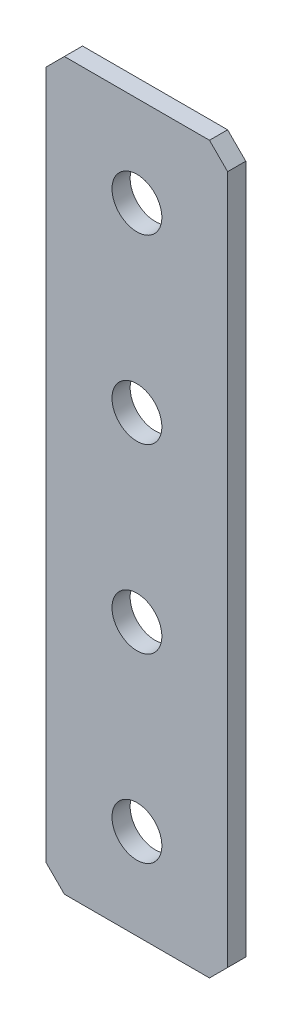
ISO-10303-21;
HEADER;
FILE_DESCRIPTION(('STEP AP214'),'2;1');
FILE_NAME('part.step','',(''),(''),'','','');
FILE_SCHEMA(('AUTOMOTIVE_DESIGN { 1 0 10303 214 1 1 1 1 }'));
ENDSEC;
DATA;
#1=APPLICATION_CONTEXT('core data for automotive mechanical design processes');
#2=APPLICATION_PROTOCOL_DEFINITION('international standard','automotive_design',2000,#1);
#3=PRODUCT_CONTEXT('',#1,'mechanical');
#4=PRODUCT('Part','Part','',(#3));
#5=PRODUCT_RELATED_PRODUCT_CATEGORY('part','',(#4));
#6=PRODUCT_DEFINITION_FORMATION('','',#4);
#7=PRODUCT_DEFINITION_CONTEXT('part definition',#1,'design');
#8=PRODUCT_DEFINITION('design','',#6,#7);
#9=PRODUCT_DEFINITION_SHAPE('','',#8);
#10=(LENGTH_UNIT() NAMED_UNIT(*) SI_UNIT(.MILLI.,.METRE.));
#11=(NAMED_UNIT(*) PLANE_ANGLE_UNIT() SI_UNIT($,.RADIAN.));
#12=(NAMED_UNIT(*) SI_UNIT($,.STERADIAN.) SOLID_ANGLE_UNIT());
#13=UNCERTAINTY_MEASURE_WITH_UNIT(LENGTH_MEASURE(1.E-05),#10,'distance_accuracy_value','');
#14=(GEOMETRIC_REPRESENTATION_CONTEXT(3) GLOBAL_UNCERTAINTY_ASSIGNED_CONTEXT((#13)) GLOBAL_UNIT_ASSIGNED_CONTEXT((#10,
#11,#12)) REPRESENTATION_CONTEXT('',''));
#15=CARTESIAN_POINT('',(0.,0.,0.));
#16=DIRECTION('',(0.,0.,1.));
#17=DIRECTION('',(1.,0.,0.));
#18=AXIS2_PLACEMENT_3D('',#15,#16,#17);
#19=CARTESIAN_POINT('',(9.99999999999999,-40.,2.));
#20=DIRECTION('',(-1.,0.,0.));
#21=DIRECTION('',(0.,0.,1.));
#22=AXIS2_PLACEMENT_3D('',#19,#20,#21);
#23=PLANE('',#22);
#24=DIRECTION('',(0.,1.,0.));
#25=VECTOR('',#24,1.);
#26=CARTESIAN_POINT('',(9.99999999999999,-40.,2.));
#27=LINE('',#26,#25);
#28=CARTESIAN_POINT('',(9.99999999999999,-38.,2.));
#29=VERTEX_POINT('',#28);
#30=CARTESIAN_POINT('',(9.99999999999999,38.,2.));
#31=VERTEX_POINT('',#30);
#32=EDGE_CURVE('E127',#29,#31,#27,.T.);
#33=ORIENTED_EDGE('',*,*,#32,.F.);
#34=DIRECTION('',(0.,0.,-1.));
#35=VECTOR('',#34,1.);
#36=CARTESIAN_POINT('',(9.99999999999999,-38.,2.));
#37=LINE('',#36,#35);
#38=CARTESIAN_POINT('',(9.99999999999999,-38.,0.));
#39=VERTEX_POINT('',#38);
#40=EDGE_CURVE('E153',#29,#39,#37,.T.);
#41=ORIENTED_EDGE('',*,*,#40,.T.);
#42=DIRECTION('',(0.,1.,0.));
#43=VECTOR('',#42,1.);
#44=CARTESIAN_POINT('',(9.99999999999999,-40.,0.));
#45=LINE('',#44,#43);
#46=CARTESIAN_POINT('',(9.99999999999999,38.,0.));
#47=VERTEX_POINT('',#46);
#48=EDGE_CURVE('E161',#39,#47,#45,.T.);
#49=ORIENTED_EDGE('',*,*,#48,.T.);
#50=DIRECTION('',(0.,0.,1.));
#51=VECTOR('',#50,1.);
#52=CARTESIAN_POINT('',(9.99999999999999,38.,2.));
#53=LINE('',#52,#51);
#54=EDGE_CURVE('E151',#47,#31,#53,.T.);
#55=ORIENTED_EDGE('',*,*,#54,.T.);
#56=EDGE_LOOP('',(#33,#41,#49,#55));
#57=FACE_BOUND('',#56,.T.);
#58=ADVANCED_FACE('F36',(#57),#23,.F.);
#59=CARTESIAN_POINT('',(-10.,40.,2.));
#60=DIRECTION('',(0.,-1.,0.));
#61=DIRECTION('',(0.,0.,-1.));
#62=AXIS2_PLACEMENT_3D('',#59,#60,#61);
#63=PLANE('',#62);
#64=DIRECTION('',(-1.,0.,0.));
#65=VECTOR('',#64,1.);
#66=CARTESIAN_POINT('',(-10.,40.,0.));
#67=LINE('',#66,#65);
#68=CARTESIAN_POINT('',(7.99999999999998,40.,0.));
#69=VERTEX_POINT('',#68);
#70=CARTESIAN_POINT('',(-8.00000000000001,40.,0.));
#71=VERTEX_POINT('',#70);
#72=EDGE_CURVE('E132',#69,#71,#67,.T.);
#73=ORIENTED_EDGE('',*,*,#72,.T.);
#74=DIRECTION('',(0.,0.,1.));
#75=VECTOR('',#74,1.);
#76=CARTESIAN_POINT('',(-8.00000000000001,40.,2.));
#77=LINE('',#76,#75);
#78=CARTESIAN_POINT('',(-8.00000000000001,40.,2.));
#79=VERTEX_POINT('',#78);
#80=EDGE_CURVE('E11',#71,#79,#77,.T.);
#81=ORIENTED_EDGE('',*,*,#80,.T.);
#82=DIRECTION('',(-1.,0.,0.));
#83=VECTOR('',#82,1.);
#84=CARTESIAN_POINT('',(-10.,40.,2.));
#85=LINE('',#84,#83);
#86=CARTESIAN_POINT('',(7.99999999999998,40.,2.));
#87=VERTEX_POINT('',#86);
#88=EDGE_CURVE('E130',#87,#79,#85,.T.);
#89=ORIENTED_EDGE('',*,*,#88,.F.);
#90=DIRECTION('',(0.,0.,-1.));
#91=VECTOR('',#90,1.);
#92=CARTESIAN_POINT('',(7.99999999999998,40.,2.));
#93=LINE('',#92,#91);
#94=EDGE_CURVE('E44',#87,#69,#93,.T.);
#95=ORIENTED_EDGE('',*,*,#94,.T.);
#96=EDGE_LOOP('',(#73,#81,#89,#95));
#97=FACE_BOUND('',#96,.T.);
#98=ADVANCED_FACE('F158',(#97),#63,.F.);
#99=CARTESIAN_POINT('',(-10.,-40.,2.));
#100=DIRECTION('',(1.,0.,0.));
#101=DIRECTION('',(0.,0.,-1.));
#102=AXIS2_PLACEMENT_3D('',#99,#100,#101);
#103=PLANE('',#102);
#104=DIRECTION('',(0.,-1.,0.));
#105=VECTOR('',#104,1.);
#106=CARTESIAN_POINT('',(-10.,-40.,0.));
#107=LINE('',#106,#105);
#108=CARTESIAN_POINT('',(-10.,38.,0.));
#109=VERTEX_POINT('',#108);
#110=CARTESIAN_POINT('',(-10.,-38.,0.));
#111=VERTEX_POINT('',#110);
#112=EDGE_CURVE('E128',#109,#111,#107,.T.);
#113=ORIENTED_EDGE('',*,*,#112,.T.);
#114=DIRECTION('',(0.,0.,1.));
#115=VECTOR('',#114,1.);
#116=CARTESIAN_POINT('',(-10.,-38.,2.));
#117=LINE('',#116,#115);
#118=CARTESIAN_POINT('',(-10.,-38.,2.));
#119=VERTEX_POINT('',#118);
#120=EDGE_CURVE('E106',#111,#119,#117,.T.);
#121=ORIENTED_EDGE('',*,*,#120,.T.);
#122=DIRECTION('',(0.,-1.,0.));
#123=VECTOR('',#122,1.);
#124=CARTESIAN_POINT('',(-10.,-40.,2.));
#125=LINE('',#124,#123);
#126=CARTESIAN_POINT('',(-10.,38.,2.));
#127=VERTEX_POINT('',#126);
#128=EDGE_CURVE('E166',#127,#119,#125,.T.);
#129=ORIENTED_EDGE('',*,*,#128,.F.);
#130=DIRECTION('',(0.,0.,-1.));
#131=VECTOR('',#130,1.);
#132=CARTESIAN_POINT('',(-10.,38.,2.));
#133=LINE('',#132,#131);
#134=EDGE_CURVE('E111',#127,#109,#133,.T.);
#135=ORIENTED_EDGE('',*,*,#134,.T.);
#136=EDGE_LOOP('',(#113,#121,#129,#135));
#137=FACE_BOUND('',#136,.T.);
#138=ADVANCED_FACE('F209',(#137),#103,.F.);
#139=CARTESIAN_POINT('',(-10.,-40.,2.));
#140=DIRECTION('',(0.,1.,0.));
#141=DIRECTION('',(0.,0.,1.));
#142=AXIS2_PLACEMENT_3D('',#139,#140,#141);
#143=PLANE('',#142);
#144=DIRECTION('',(1.,0.,0.));
#145=VECTOR('',#144,1.);
#146=CARTESIAN_POINT('',(-10.,-40.,2.));
#147=LINE('',#146,#145);
#148=CARTESIAN_POINT('',(-7.99999999999999,-40.,2.));
#149=VERTEX_POINT('',#148);
#150=CARTESIAN_POINT('',(7.99999999999997,-40.,2.));
#151=VERTEX_POINT('',#150);
#152=EDGE_CURVE('E121',#149,#151,#147,.T.);
#153=ORIENTED_EDGE('',*,*,#152,.F.);
#154=DIRECTION('',(0.,0.,-1.));
#155=VECTOR('',#154,1.);
#156=CARTESIAN_POINT('',(-7.99999999999999,-40.,2.));
#157=LINE('',#156,#155);
#158=CARTESIAN_POINT('',(-7.99999999999999,-40.,0.));
#159=VERTEX_POINT('',#158);
#160=EDGE_CURVE('E105',#149,#159,#157,.T.);
#161=ORIENTED_EDGE('',*,*,#160,.T.);
#162=DIRECTION('',(1.,0.,0.));
#163=VECTOR('',#162,1.);
#164=CARTESIAN_POINT('',(-10.,-40.,0.));
#165=LINE('',#164,#163);
#166=CARTESIAN_POINT('',(7.99999999999997,-40.,0.));
#167=VERTEX_POINT('',#166);
#168=EDGE_CURVE('E118',#159,#167,#165,.T.);
#169=ORIENTED_EDGE('',*,*,#168,.T.);
#170=DIRECTION('',(0.,0.,1.));
#171=VECTOR('',#170,1.);
#172=CARTESIAN_POINT('',(7.99999999999997,-40.,2.));
#173=LINE('',#172,#171);
#174=EDGE_CURVE('E123',#167,#151,#173,.T.);
#175=ORIENTED_EDGE('',*,*,#174,.T.);
#176=EDGE_LOOP('',(#153,#161,#169,#175));
#177=FACE_BOUND('',#176,.T.);
#178=ADVANCED_FACE('F117',(#177),#143,.F.);
#179=CARTESIAN_POINT('',(0.,0.,2.));
#180=DIRECTION('',(0.,0.,-1.));
#181=DIRECTION('',(-1.,0.,0.));
#182=AXIS2_PLACEMENT_3D('',#179,#180,#181);
#183=PLANE('',#182);
#184=CARTESIAN_POINT('',(0.,30.,2.));
#185=DIRECTION('',(0.,0.,1.));
#186=DIRECTION('',(1.,0.,0.));
#187=AXIS2_PLACEMENT_3D('',#184,#185,#186);
#188=CIRCLE('',#187,2.75);
#189=CARTESIAN_POINT('',(2.75,30.,2.));
#190=VERTEX_POINT('',#189);
#191=EDGE_CURVE('E190',#190,#190,#188,.T.);
#192=ORIENTED_EDGE('',*,*,#191,.F.);
#193=EDGE_LOOP('',(#192));
#194=FACE_BOUND('',#193,.T.);
#195=CARTESIAN_POINT('',(0.,10.,2.));
#196=DIRECTION('',(0.,0.,1.));
#197=DIRECTION('',(1.,0.,0.));
#198=AXIS2_PLACEMENT_3D('',#195,#196,#197);
#199=CIRCLE('',#198,2.75);
#200=CARTESIAN_POINT('',(2.75,10.,2.));
#201=VERTEX_POINT('',#200);
#202=EDGE_CURVE('E184',#201,#201,#199,.T.);
#203=ORIENTED_EDGE('',*,*,#202,.F.);
#204=EDGE_LOOP('',(#203));
#205=FACE_BOUND('',#204,.T.);
#206=CARTESIAN_POINT('',(0.,-10.,2.));
#207=DIRECTION('',(0.,0.,1.));
#208=DIRECTION('',(1.,0.,0.));
#209=AXIS2_PLACEMENT_3D('',#206,#207,#208);
#210=CIRCLE('',#209,2.75);
#211=CARTESIAN_POINT('',(2.75000000000001,-10.,2.));
#212=VERTEX_POINT('',#211);
#213=EDGE_CURVE('E178',#212,#212,#210,.T.);
#214=ORIENTED_EDGE('',*,*,#213,.F.);
#215=EDGE_LOOP('',(#214));
#216=FACE_BOUND('',#215,.T.);
#217=CARTESIAN_POINT('',(0.,-30.,2.));
#218=DIRECTION('',(0.,0.,1.));
#219=DIRECTION('',(1.,0.,0.));
#220=AXIS2_PLACEMENT_3D('',#217,#218,#219);
#221=CIRCLE('',#220,2.75);
#222=CARTESIAN_POINT('',(2.75000000000001,-30.,2.));
#223=VERTEX_POINT('',#222);
#224=EDGE_CURVE('E172',#223,#223,#221,.T.);
#225=ORIENTED_EDGE('',*,*,#224,.F.);
#226=EDGE_LOOP('',(#225));
#227=FACE_BOUND('',#226,.T.);
#228=ORIENTED_EDGE('',*,*,#128,.T.);
#229=DIRECTION('',(-0.707106781186546,0.707106781186549,0.));
#230=VECTOR('',#229,1.);
#231=CARTESIAN_POINT('',(-7.99999999999999,-40.,2.));
#232=LINE('',#231,#230);
#233=EDGE_CURVE('E149',#119,#149,#232,.F.);
#234=ORIENTED_EDGE('',*,*,#233,.T.);
#235=ORIENTED_EDGE('',*,*,#152,.T.);
#236=DIRECTION('',(-0.707106781186549,-0.707106781186546,0.));
#237=VECTOR('',#236,1.);
#238=CARTESIAN_POINT('',(9.99999999999999,-38.,2.));
#239=LINE('',#238,#237);
#240=EDGE_CURVE('E147',#151,#29,#239,.F.);
#241=ORIENTED_EDGE('',*,*,#240,.T.);
#242=ORIENTED_EDGE('',*,*,#32,.T.);
#243=DIRECTION('',(0.707106781186546,-0.707106781186549,0.));
#244=VECTOR('',#243,1.);
#245=CARTESIAN_POINT('',(7.99999999999998,40.,2.));
#246=LINE('',#245,#244);
#247=EDGE_CURVE('E56',#31,#87,#246,.F.);
#248=ORIENTED_EDGE('',*,*,#247,.T.);
#249=ORIENTED_EDGE('',*,*,#88,.T.);
#250=DIRECTION('',(0.707106781186548,0.707106781186548,0.));
#251=VECTOR('',#250,1.);
#252=CARTESIAN_POINT('',(-10.,38.,2.));
#253=LINE('',#252,#251);
#254=EDGE_CURVE('E145',#79,#127,#253,.F.);
#255=ORIENTED_EDGE('',*,*,#254,.T.);
#256=EDGE_LOOP('',(#228,#234,#235,#241,#242,#248,#249,#255));
#257=FACE_BOUND('',#256,.T.);
#258=ADVANCED_FACE('F196',(#194,#205,#216,#227,#257),#183,.F.);
#259=CARTESIAN_POINT('',(0.,0.,0.));
#260=DIRECTION('',(0.,0.,-1.));
#261=DIRECTION('',(-1.,0.,0.));
#262=AXIS2_PLACEMENT_3D('',#259,#260,#261);
#263=PLANE('',#262);
#264=CARTESIAN_POINT('',(0.,30.,0.));
#265=DIRECTION('',(0.,0.,1.));
#266=DIRECTION('',(1.,0.,0.));
#267=AXIS2_PLACEMENT_3D('',#264,#265,#266);
#268=CIRCLE('',#267,2.75);
#269=CARTESIAN_POINT('',(2.75,30.,0.));
#270=VERTEX_POINT('',#269);
#271=EDGE_CURVE('E187',#270,#270,#268,.T.);
#272=ORIENTED_EDGE('',*,*,#271,.T.);
#273=EDGE_LOOP('',(#272));
#274=FACE_BOUND('',#273,.T.);
#275=CARTESIAN_POINT('',(0.,10.,0.));
#276=DIRECTION('',(0.,0.,1.));
#277=DIRECTION('',(1.,0.,0.));
#278=AXIS2_PLACEMENT_3D('',#275,#276,#277);
#279=CIRCLE('',#278,2.75);
#280=CARTESIAN_POINT('',(2.75,10.,0.));
#281=VERTEX_POINT('',#280);
#282=EDGE_CURVE('E181',#281,#281,#279,.T.);
#283=ORIENTED_EDGE('',*,*,#282,.T.);
#284=EDGE_LOOP('',(#283));
#285=FACE_BOUND('',#284,.T.);
#286=CARTESIAN_POINT('',(0.,-10.,0.));
#287=DIRECTION('',(0.,0.,1.));
#288=DIRECTION('',(1.,0.,0.));
#289=AXIS2_PLACEMENT_3D('',#286,#287,#288);
#290=CIRCLE('',#289,2.75);
#291=CARTESIAN_POINT('',(2.75000000000001,-10.,0.));
#292=VERTEX_POINT('',#291);
#293=EDGE_CURVE('E175',#292,#292,#290,.T.);
#294=ORIENTED_EDGE('',*,*,#293,.T.);
#295=EDGE_LOOP('',(#294));
#296=FACE_BOUND('',#295,.T.);
#297=CARTESIAN_POINT('',(0.,-30.,0.));
#298=DIRECTION('',(0.,0.,1.));
#299=DIRECTION('',(1.,0.,0.));
#300=AXIS2_PLACEMENT_3D('',#297,#298,#299);
#301=CIRCLE('',#300,2.75);
#302=CARTESIAN_POINT('',(2.75000000000001,-30.,0.));
#303=VERTEX_POINT('',#302);
#304=EDGE_CURVE('E162',#303,#303,#301,.T.);
#305=ORIENTED_EDGE('',*,*,#304,.T.);
#306=EDGE_LOOP('',(#305));
#307=FACE_BOUND('',#306,.T.);
#308=ORIENTED_EDGE('',*,*,#168,.F.);
#309=DIRECTION('',(0.707106781186546,-0.707106781186549,0.));
#310=VECTOR('',#309,1.);
#311=CARTESIAN_POINT('',(-24.,-23.9999999999999,0.));
#312=LINE('',#311,#310);
#313=EDGE_CURVE('E101',#159,#111,#312,.F.);
#314=ORIENTED_EDGE('',*,*,#313,.T.);
#315=ORIENTED_EDGE('',*,*,#112,.F.);
#316=DIRECTION('',(-0.707106781186548,-0.707106781186548,0.));
#317=VECTOR('',#316,1.);
#318=CARTESIAN_POINT('',(-24.,24.,0.));
#319=LINE('',#318,#317);
#320=EDGE_CURVE('E138',#109,#71,#319,.F.);
#321=ORIENTED_EDGE('',*,*,#320,.T.);
#322=ORIENTED_EDGE('',*,*,#72,.F.);
#323=DIRECTION('',(-0.707106781186546,0.707106781186549,0.));
#324=VECTOR('',#323,1.);
#325=CARTESIAN_POINT('',(24.,23.9999999999999,0.));
#326=LINE('',#325,#324);
#327=EDGE_CURVE('E122',#69,#47,#326,.F.);
#328=ORIENTED_EDGE('',*,*,#327,.T.);
#329=ORIENTED_EDGE('',*,*,#48,.F.);
#330=DIRECTION('',(0.707106781186549,0.707106781186546,0.));
#331=VECTOR('',#330,1.);
#332=CARTESIAN_POINT('',(24.,-24.0000000000001,0.));
#333=LINE('',#332,#331);
#334=EDGE_CURVE('E112',#39,#167,#333,.F.);
#335=ORIENTED_EDGE('',*,*,#334,.T.);
#336=EDGE_LOOP('',(#308,#314,#315,#321,#322,#328,#329,#335));
#337=FACE_BOUND('',#336,.T.);
#338=ADVANCED_FACE('F125',(#274,#285,#296,#307,#337),#263,.T.);
#339=CARTESIAN_POINT('',(-7.99999999999999,-40.,2.));
#340=DIRECTION('',(0.707106781186549,0.707106781186546,0.));
#341=DIRECTION('',(0.,0.,-1.));
#342=AXIS2_PLACEMENT_3D('',#339,#340,#341);
#343=PLANE('',#342);
#344=ORIENTED_EDGE('',*,*,#233,.F.);
#345=ORIENTED_EDGE('',*,*,#120,.F.);
#346=ORIENTED_EDGE('',*,*,#313,.F.);
#347=ORIENTED_EDGE('',*,*,#160,.F.);
#348=EDGE_LOOP('',(#344,#345,#346,#347));
#349=FACE_BOUND('',#348,.T.);
#350=ADVANCED_FACE('F104',(#349),#343,.F.);
#351=CARTESIAN_POINT('',(9.99999999999999,-38.,2.));
#352=DIRECTION('',(-0.707106781186546,0.707106781186549,0.));
#353=DIRECTION('',(0.,0.,-1.));
#354=AXIS2_PLACEMENT_3D('',#351,#352,#353);
#355=PLANE('',#354);
#356=ORIENTED_EDGE('',*,*,#240,.F.);
#357=ORIENTED_EDGE('',*,*,#174,.F.);
#358=ORIENTED_EDGE('',*,*,#334,.F.);
#359=ORIENTED_EDGE('',*,*,#40,.F.);
#360=EDGE_LOOP('',(#356,#357,#358,#359));
#361=FACE_BOUND('',#360,.T.);
#362=ADVANCED_FACE('F213',(#361),#355,.F.);
#363=CARTESIAN_POINT('',(-10.,38.,2.));
#364=DIRECTION('',(0.707106781186547,-0.707106781186547,0.));
#365=DIRECTION('',(0.,0.,-1.));
#366=AXIS2_PLACEMENT_3D('',#363,#364,#365);
#367=PLANE('',#366);
#368=ORIENTED_EDGE('',*,*,#254,.F.);
#369=ORIENTED_EDGE('',*,*,#80,.F.);
#370=ORIENTED_EDGE('',*,*,#320,.F.);
#371=ORIENTED_EDGE('',*,*,#134,.F.);
#372=EDGE_LOOP('',(#368,#369,#370,#371));
#373=FACE_BOUND('',#372,.T.);
#374=ADVANCED_FACE('F211',(#373),#367,.F.);
#375=CARTESIAN_POINT('',(7.99999999999998,40.,2.));
#376=DIRECTION('',(-0.707106781186549,-0.707106781186546,0.));
#377=DIRECTION('',(0.,0.,-1.));
#378=AXIS2_PLACEMENT_3D('',#375,#376,#377);
#379=PLANE('',#378);
#380=ORIENTED_EDGE('',*,*,#247,.F.);
#381=ORIENTED_EDGE('',*,*,#54,.F.);
#382=ORIENTED_EDGE('',*,*,#327,.F.);
#383=ORIENTED_EDGE('',*,*,#94,.F.);
#384=EDGE_LOOP('',(#380,#381,#382,#383));
#385=FACE_BOUND('',#384,.T.);
#386=ADVANCED_FACE('F38',(#385),#379,.F.);
#387=CARTESIAN_POINT('',(0.,-30.,2.));
#388=DIRECTION('',(0.,0.,1.));
#389=DIRECTION('',(1.,0.,0.));
#390=AXIS2_PLACEMENT_3D('',#387,#388,#389);
#391=CYLINDRICAL_SURFACE('',#390,2.75);
#392=ORIENTED_EDGE('',*,*,#304,.F.);
#393=EDGE_LOOP('',(#392));
#394=FACE_BOUND('',#393,.T.);
#395=ORIENTED_EDGE('',*,*,#224,.T.);
#396=EDGE_LOOP('',(#395));
#397=FACE_BOUND('',#396,.T.);
#398=ADVANCED_FACE('F218',(#394,#397),#391,.F.);
#399=CARTESIAN_POINT('',(0.,-10.,2.));
#400=DIRECTION('',(0.,0.,1.));
#401=DIRECTION('',(1.,0.,0.));
#402=AXIS2_PLACEMENT_3D('',#399,#400,#401);
#403=CYLINDRICAL_SURFACE('',#402,2.75);
#404=ORIENTED_EDGE('',*,*,#293,.F.);
#405=EDGE_LOOP('',(#404));
#406=FACE_BOUND('',#405,.T.);
#407=ORIENTED_EDGE('',*,*,#213,.T.);
#408=EDGE_LOOP('',(#407));
#409=FACE_BOUND('',#408,.T.);
#410=ADVANCED_FACE('F273',(#406,#409),#403,.F.);
#411=CARTESIAN_POINT('',(0.,10.,2.));
#412=DIRECTION('',(0.,0.,1.));
#413=DIRECTION('',(1.,0.,0.));
#414=AXIS2_PLACEMENT_3D('',#411,#412,#413);
#415=CYLINDRICAL_SURFACE('',#414,2.75);
#416=ORIENTED_EDGE('',*,*,#282,.F.);
#417=EDGE_LOOP('',(#416));
#418=FACE_BOUND('',#417,.T.);
#419=ORIENTED_EDGE('',*,*,#202,.T.);
#420=EDGE_LOOP('',(#419));
#421=FACE_BOUND('',#420,.T.);
#422=ADVANCED_FACE('F282',(#418,#421),#415,.F.);
#423=CARTESIAN_POINT('',(0.,30.,2.));
#424=DIRECTION('',(0.,0.,1.));
#425=DIRECTION('',(1.,0.,0.));
#426=AXIS2_PLACEMENT_3D('',#423,#424,#425);
#427=CYLINDRICAL_SURFACE('',#426,2.75);
#428=ORIENTED_EDGE('',*,*,#271,.F.);
#429=EDGE_LOOP('',(#428));
#430=FACE_BOUND('',#429,.T.);
#431=ORIENTED_EDGE('',*,*,#191,.T.);
#432=EDGE_LOOP('',(#431));
#433=FACE_BOUND('',#432,.T.);
#434=ADVANCED_FACE('F194',(#430,#433),#427,.F.);
#435=CLOSED_SHELL('',(#58,#98,#138,#178,#258,#338,#350,#362,#374,#386,#398,#410,#422,#434));
#436=MANIFOLD_SOLID_BREP('B2',#435);
#437=ADVANCED_BREP_SHAPE_REPRESENTATION('',(#18,#436),#14);
#438=SHAPE_DEFINITION_REPRESENTATION(#9,#437);
ENDSEC;
END-ISO-10303-21;
